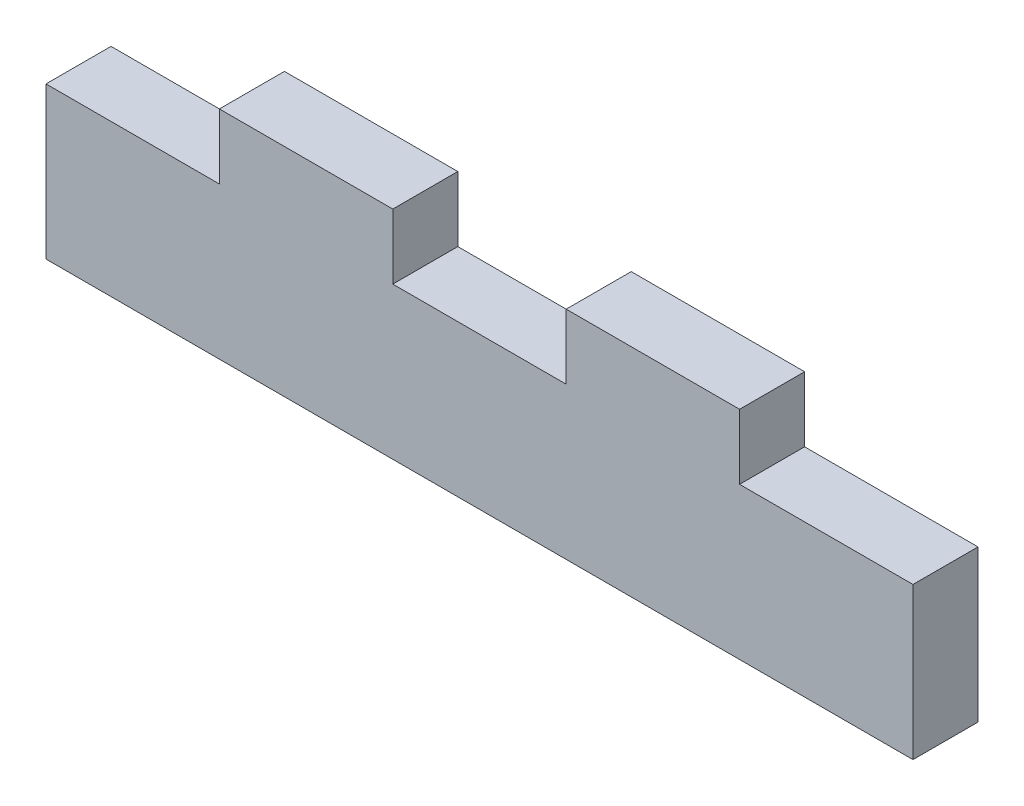
ISO-10303-21;
HEADER;
FILE_DESCRIPTION(('STEP AP214'),'2;1');
FILE_NAME('part.step','',(''),(''),'','','');
FILE_SCHEMA(('AUTOMOTIVE_DESIGN { 1 0 10303 214 1 1 1 1 }'));
ENDSEC;
DATA;
#1=APPLICATION_CONTEXT('core data for automotive mechanical design processes');
#2=APPLICATION_PROTOCOL_DEFINITION('international standard','automotive_design',2000,#1);
#3=PRODUCT_CONTEXT('',#1,'mechanical');
#4=PRODUCT('Part','Part','',(#3));
#5=PRODUCT_RELATED_PRODUCT_CATEGORY('part','',(#4));
#6=PRODUCT_DEFINITION_FORMATION('','',#4);
#7=PRODUCT_DEFINITION_CONTEXT('part definition',#1,'design');
#8=PRODUCT_DEFINITION('design','',#6,#7);
#9=PRODUCT_DEFINITION_SHAPE('','',#8);
#10=(LENGTH_UNIT() NAMED_UNIT(*) SI_UNIT(.MILLI.,.METRE.));
#11=(NAMED_UNIT(*) PLANE_ANGLE_UNIT() SI_UNIT($,.RADIAN.));
#12=(NAMED_UNIT(*) SI_UNIT($,.STERADIAN.) SOLID_ANGLE_UNIT());
#13=UNCERTAINTY_MEASURE_WITH_UNIT(LENGTH_MEASURE(1.E-05),#10,'distance_accuracy_value','');
#14=(GEOMETRIC_REPRESENTATION_CONTEXT(3) GLOBAL_UNCERTAINTY_ASSIGNED_CONTEXT((#13)) GLOBAL_UNIT_ASSIGNED_CONTEXT((#10,
#11,#12)) REPRESENTATION_CONTEXT('',''));
#15=CARTESIAN_POINT('',(0.,0.,0.));
#16=DIRECTION('',(0.,0.,1.));
#17=DIRECTION('',(1.,0.,0.));
#18=AXIS2_PLACEMENT_3D('',#15,#16,#17);
#19=CARTESIAN_POINT('',(20.,-5.,1.5));
#20=DIRECTION('',(-1.,0.,0.));
#21=DIRECTION('',(0.,0.,1.));
#22=AXIS2_PLACEMENT_3D('',#19,#20,#21);
#23=PLANE('',#22);
#24=DIRECTION('',(0.,0.,-1.));
#25=VECTOR('',#24,1.);
#26=CARTESIAN_POINT('',(20.,2.,-1.5));
#27=LINE('',#26,#25);
#28=CARTESIAN_POINT('',(20.,2.,1.5));
#29=VERTEX_POINT('',#28);
#30=CARTESIAN_POINT('',(20.,2.,-1.5));
#31=VERTEX_POINT('',#30);
#32=EDGE_CURVE('E143',#29,#31,#27,.T.);
#33=ORIENTED_EDGE('',*,*,#32,.F.);
#34=DIRECTION('',(0.,1.,0.));
#35=VECTOR('',#34,1.);
#36=CARTESIAN_POINT('',(20.,-5.,1.5));
#37=LINE('',#36,#35);
#38=CARTESIAN_POINT('',(20.,-5.,1.5));
#39=VERTEX_POINT('',#38);
#40=EDGE_CURVE('E151',#39,#29,#37,.T.);
#41=ORIENTED_EDGE('',*,*,#40,.F.);
#42=DIRECTION('',(0.,0.,-1.));
#43=VECTOR('',#42,1.);
#44=CARTESIAN_POINT('',(20.,-5.,1.5));
#45=LINE('',#44,#43);
#46=CARTESIAN_POINT('',(20.,-5.,-1.5));
#47=VERTEX_POINT('',#46);
#48=EDGE_CURVE('E162',#39,#47,#45,.T.);
#49=ORIENTED_EDGE('',*,*,#48,.T.);
#50=DIRECTION('',(0.,1.,0.));
#51=VECTOR('',#50,1.);
#52=CARTESIAN_POINT('',(20.,-5.,-1.5));
#53=LINE('',#52,#51);
#54=EDGE_CURVE('E132',#47,#31,#53,.T.);
#55=ORIENTED_EDGE('',*,*,#54,.T.);
#56=EDGE_LOOP('',(#33,#41,#49,#55));
#57=FACE_BOUND('',#56,.T.);
#58=ADVANCED_FACE('F35',(#57),#23,.F.);
#59=CARTESIAN_POINT('',(-20.,5.,1.5));
#60=DIRECTION('',(0.,-1.,0.));
#61=DIRECTION('',(0.,0.,-1.));
#62=AXIS2_PLACEMENT_3D('',#59,#60,#61);
#63=PLANE('',#62);
#64=DIRECTION('',(0.,0.,-1.));
#65=VECTOR('',#64,1.);
#66=CARTESIAN_POINT('',(-12.,5.,1.5));
#67=LINE('',#66,#65);
#68=CARTESIAN_POINT('',(-12.,5.,1.5));
#69=VERTEX_POINT('',#68);
#70=CARTESIAN_POINT('',(-12.,5.,-1.5));
#71=VERTEX_POINT('',#70);
#72=EDGE_CURVE('E127',#69,#71,#67,.T.);
#73=ORIENTED_EDGE('',*,*,#72,.F.);
#74=DIRECTION('',(-1.,0.,0.));
#75=VECTOR('',#74,1.);
#76=CARTESIAN_POINT('',(-20.,5.,1.5));
#77=LINE('',#76,#75);
#78=CARTESIAN_POINT('',(-4.,5.,1.5));
#79=VERTEX_POINT('',#78);
#80=EDGE_CURVE('E139',#79,#69,#77,.T.);
#81=ORIENTED_EDGE('',*,*,#80,.F.);
#82=DIRECTION('',(0.,0.,1.));
#83=VECTOR('',#82,1.);
#84=CARTESIAN_POINT('',(-4.,5.,-1.5));
#85=LINE('',#84,#83);
#86=CARTESIAN_POINT('',(-4.,5.,-1.5));
#87=VERTEX_POINT('',#86);
#88=EDGE_CURVE('E142',#87,#79,#85,.T.);
#89=ORIENTED_EDGE('',*,*,#88,.F.);
#90=DIRECTION('',(-1.,0.,0.));
#91=VECTOR('',#90,1.);
#92=CARTESIAN_POINT('',(-20.,5.,-1.5));
#93=LINE('',#92,#91);
#94=EDGE_CURVE('E141',#87,#71,#93,.T.);
#95=ORIENTED_EDGE('',*,*,#94,.T.);
#96=EDGE_LOOP('',(#73,#81,#89,#95));
#97=FACE_BOUND('',#96,.T.);
#98=ADVANCED_FACE('F137',(#97),#63,.F.);
#99=DIRECTION('',(0.,0.,-1.));
#100=VECTOR('',#99,1.);
#101=CARTESIAN_POINT('',(4.,5.,1.5));
#102=LINE('',#101,#100);
#103=CARTESIAN_POINT('',(4.,5.,1.5));
#104=VERTEX_POINT('',#103);
#105=CARTESIAN_POINT('',(4.,5.,-1.5));
#106=VERTEX_POINT('',#105);
#107=EDGE_CURVE('E224',#104,#106,#102,.T.);
#108=ORIENTED_EDGE('',*,*,#107,.F.);
#109=CARTESIAN_POINT('',(12.,5.,1.5));
#110=VERTEX_POINT('',#109);
#111=EDGE_CURVE('E150',#110,#104,#77,.T.);
#112=ORIENTED_EDGE('',*,*,#111,.F.);
#113=DIRECTION('',(0.,0.,1.));
#114=VECTOR('',#113,1.);
#115=CARTESIAN_POINT('',(12.,5.,-1.5));
#116=LINE('',#115,#114);
#117=CARTESIAN_POINT('',(12.,5.,-1.5));
#118=VERTEX_POINT('',#117);
#119=EDGE_CURVE('E212',#118,#110,#116,.T.);
#120=ORIENTED_EDGE('',*,*,#119,.F.);
#121=EDGE_CURVE('E166',#118,#106,#93,.T.);
#122=ORIENTED_EDGE('',*,*,#121,.T.);
#123=EDGE_LOOP('',(#108,#112,#120,#122));
#124=FACE_BOUND('',#123,.T.);
#125=ADVANCED_FACE('F226',(#124),#63,.F.);
#126=CARTESIAN_POINT('',(-20.,-5.,1.5));
#127=DIRECTION('',(1.,0.,0.));
#128=DIRECTION('',(0.,0.,-1.));
#129=AXIS2_PLACEMENT_3D('',#126,#127,#128);
#130=PLANE('',#129);
#131=DIRECTION('',(0.,0.,1.));
#132=VECTOR('',#131,1.);
#133=CARTESIAN_POINT('',(-20.,2.,-1.5));
#134=LINE('',#133,#132);
#135=CARTESIAN_POINT('',(-20.,2.,-1.5));
#136=VERTEX_POINT('',#135);
#137=CARTESIAN_POINT('',(-20.,2.,1.5));
#138=VERTEX_POINT('',#137);
#139=EDGE_CURVE('E232',#136,#138,#134,.T.);
#140=ORIENTED_EDGE('',*,*,#139,.F.);
#141=DIRECTION('',(0.,-1.,0.));
#142=VECTOR('',#141,1.);
#143=CARTESIAN_POINT('',(-20.,-5.,-1.5));
#144=LINE('',#143,#142);
#145=CARTESIAN_POINT('',(-20.,-5.,-1.5));
#146=VERTEX_POINT('',#145);
#147=EDGE_CURVE('E167',#136,#146,#144,.T.);
#148=ORIENTED_EDGE('',*,*,#147,.T.);
#149=DIRECTION('',(0.,0.,-1.));
#150=VECTOR('',#149,1.);
#151=CARTESIAN_POINT('',(-20.,-5.,1.5));
#152=LINE('',#151,#150);
#153=CARTESIAN_POINT('',(-20.,-5.,1.5));
#154=VERTEX_POINT('',#153);
#155=EDGE_CURVE('E171',#154,#146,#152,.T.);
#156=ORIENTED_EDGE('',*,*,#155,.F.);
#157=DIRECTION('',(0.,-1.,0.));
#158=VECTOR('',#157,1.);
#159=CARTESIAN_POINT('',(-20.,-5.,1.5));
#160=LINE('',#159,#158);
#161=EDGE_CURVE('E154',#138,#154,#160,.T.);
#162=ORIENTED_EDGE('',*,*,#161,.F.);
#163=EDGE_LOOP('',(#140,#148,#156,#162));
#164=FACE_BOUND('',#163,.T.);
#165=ADVANCED_FACE('F238',(#164),#130,.F.);
#166=CARTESIAN_POINT('',(0.,0.,1.5));
#167=DIRECTION('',(0.,0.,-1.));
#168=DIRECTION('',(-1.,0.,0.));
#169=AXIS2_PLACEMENT_3D('',#166,#167,#168);
#170=PLANE('',#169);
#171=DIRECTION('',(0.,-1.,0.));
#172=VECTOR('',#171,1.);
#173=CARTESIAN_POINT('',(-12.,5.,1.5));
#174=LINE('',#173,#172);
#175=CARTESIAN_POINT('',(-12.,2.,1.5));
#176=VERTEX_POINT('',#175);
#177=EDGE_CURVE('E124',#69,#176,#174,.T.);
#178=ORIENTED_EDGE('',*,*,#177,.T.);
#179=DIRECTION('',(1.,0.,0.));
#180=VECTOR('',#179,1.);
#181=CARTESIAN_POINT('',(-20.,2.,1.5));
#182=LINE('',#181,#180);
#183=EDGE_CURVE('E198',#138,#176,#182,.T.);
#184=ORIENTED_EDGE('',*,*,#183,.F.);
#185=ORIENTED_EDGE('',*,*,#161,.T.);
#186=DIRECTION('',(1.,0.,0.));
#187=VECTOR('',#186,1.);
#188=CARTESIAN_POINT('',(-20.,-5.,1.5));
#189=LINE('',#188,#187);
#190=EDGE_CURVE('E160',#154,#39,#189,.T.);
#191=ORIENTED_EDGE('',*,*,#190,.T.);
#192=ORIENTED_EDGE('',*,*,#40,.T.);
#193=DIRECTION('',(1.,0.,0.));
#194=VECTOR('',#193,1.);
#195=CARTESIAN_POINT('',(12.,2.,1.5));
#196=LINE('',#195,#194);
#197=CARTESIAN_POINT('',(12.,2.,1.5));
#198=VERTEX_POINT('',#197);
#199=EDGE_CURVE('E205',#198,#29,#196,.T.);
#200=ORIENTED_EDGE('',*,*,#199,.F.);
#201=DIRECTION('',(0.,-1.,0.));
#202=VECTOR('',#201,1.);
#203=CARTESIAN_POINT('',(12.,5.,1.5));
#204=LINE('',#203,#202);
#205=EDGE_CURVE('E208',#110,#198,#204,.T.);
#206=ORIENTED_EDGE('',*,*,#205,.F.);
#207=ORIENTED_EDGE('',*,*,#111,.T.);
#208=DIRECTION('',(0.,-1.,0.));
#209=VECTOR('',#208,1.);
#210=CARTESIAN_POINT('',(4.,5.,1.5));
#211=LINE('',#210,#209);
#212=CARTESIAN_POINT('',(4.,2.,1.5));
#213=VERTEX_POINT('',#212);
#214=EDGE_CURVE('E215',#104,#213,#211,.T.);
#215=ORIENTED_EDGE('',*,*,#214,.T.);
#216=DIRECTION('',(1.,0.,0.));
#217=VECTOR('',#216,1.);
#218=CARTESIAN_POINT('',(-4.,2.,1.5));
#219=LINE('',#218,#217);
#220=CARTESIAN_POINT('',(-4.,2.,1.5));
#221=VERTEX_POINT('',#220);
#222=EDGE_CURVE('E195',#221,#213,#219,.T.);
#223=ORIENTED_EDGE('',*,*,#222,.F.);
#224=DIRECTION('',(0.,-1.,0.));
#225=VECTOR('',#224,1.);
#226=CARTESIAN_POINT('',(-4.,5.,1.5));
#227=LINE('',#226,#225);
#228=EDGE_CURVE('E149',#79,#221,#227,.T.);
#229=ORIENTED_EDGE('',*,*,#228,.F.);
#230=ORIENTED_EDGE('',*,*,#80,.T.);
#231=EDGE_LOOP('',(#178,#184,#185,#191,#192,#200,#206,#207,#215,#223,#229,#230));
#232=FACE_BOUND('',#231,.T.);
#233=ADVANCED_FACE('F146',(#232),#170,.F.);
#234=CARTESIAN_POINT('',(0.,0.,-1.5));
#235=DIRECTION('',(0.,0.,-1.));
#236=DIRECTION('',(-1.,0.,0.));
#237=AXIS2_PLACEMENT_3D('',#234,#235,#236);
#238=PLANE('',#237);
#239=ORIENTED_EDGE('',*,*,#147,.F.);
#240=DIRECTION('',(1.,0.,0.));
#241=VECTOR('',#240,1.);
#242=CARTESIAN_POINT('',(0.,2.,-1.5));
#243=LINE('',#242,#241);
#244=CARTESIAN_POINT('',(-12.,2.,-1.5));
#245=VERTEX_POINT('',#244);
#246=EDGE_CURVE('E11',#136,#245,#243,.T.);
#247=ORIENTED_EDGE('',*,*,#246,.T.);
#248=DIRECTION('',(0.,-1.,0.));
#249=VECTOR('',#248,1.);
#250=CARTESIAN_POINT('',(-12.,5.,-1.5));
#251=LINE('',#250,#249);
#252=EDGE_CURVE('E50',#71,#245,#251,.T.);
#253=ORIENTED_EDGE('',*,*,#252,.F.);
#254=ORIENTED_EDGE('',*,*,#94,.F.);
#255=DIRECTION('',(0.,-1.,0.));
#256=VECTOR('',#255,1.);
#257=CARTESIAN_POINT('',(-4.,5.,-1.5));
#258=LINE('',#257,#256);
#259=CARTESIAN_POINT('',(-4.,2.,-1.5));
#260=VERTEX_POINT('',#259);
#261=EDGE_CURVE('E187',#87,#260,#258,.T.);
#262=ORIENTED_EDGE('',*,*,#261,.T.);
#263=CARTESIAN_POINT('',(4.,2.,-1.5));
#264=VERTEX_POINT('',#263);
#265=EDGE_CURVE('E43',#260,#264,#243,.T.);
#266=ORIENTED_EDGE('',*,*,#265,.T.);
#267=DIRECTION('',(0.,-1.,0.));
#268=VECTOR('',#267,1.);
#269=CARTESIAN_POINT('',(4.,5.,-1.5));
#270=LINE('',#269,#268);
#271=EDGE_CURVE('E58',#106,#264,#270,.T.);
#272=ORIENTED_EDGE('',*,*,#271,.F.);
#273=ORIENTED_EDGE('',*,*,#121,.F.);
#274=DIRECTION('',(0.,-1.,0.));
#275=VECTOR('',#274,1.);
#276=CARTESIAN_POINT('',(12.,5.,-1.5));
#277=LINE('',#276,#275);
#278=CARTESIAN_POINT('',(12.,2.,-1.5));
#279=VERTEX_POINT('',#278);
#280=EDGE_CURVE('E211',#118,#279,#277,.T.);
#281=ORIENTED_EDGE('',*,*,#280,.T.);
#282=EDGE_CURVE('E38',#279,#31,#243,.T.);
#283=ORIENTED_EDGE('',*,*,#282,.T.);
#284=ORIENTED_EDGE('',*,*,#54,.F.);
#285=DIRECTION('',(1.,0.,0.));
#286=VECTOR('',#285,1.);
#287=CARTESIAN_POINT('',(-20.,-5.,-1.5));
#288=LINE('',#287,#286);
#289=EDGE_CURVE('E156',#146,#47,#288,.T.);
#290=ORIENTED_EDGE('',*,*,#289,.F.);
#291=EDGE_LOOP('',(#239,#247,#253,#254,#262,#266,#272,#273,#281,#283,#284,#290));
#292=FACE_BOUND('',#291,.T.);
#293=ADVANCED_FACE('F184',(#292),#238,.T.);
#294=CARTESIAN_POINT('',(-20.,-5.,1.5));
#295=DIRECTION('',(0.,1.,0.));
#296=DIRECTION('',(0.,0.,1.));
#297=AXIS2_PLACEMENT_3D('',#294,#295,#296);
#298=PLANE('',#297);
#299=ORIENTED_EDGE('',*,*,#289,.T.);
#300=ORIENTED_EDGE('',*,*,#48,.F.);
#301=ORIENTED_EDGE('',*,*,#190,.F.);
#302=ORIENTED_EDGE('',*,*,#155,.T.);
#303=EDGE_LOOP('',(#299,#300,#301,#302));
#304=FACE_BOUND('',#303,.T.);
#305=ADVANCED_FACE('F240',(#304),#298,.F.);
#306=CARTESIAN_POINT('',(0.,2.,-5.));
#307=DIRECTION('',(0.,1.,0.));
#308=DIRECTION('',(0.,0.,1.));
#309=AXIS2_PLACEMENT_3D('',#306,#307,#308);
#310=PLANE('',#309);
#311=DIRECTION('',(0.,0.,1.));
#312=VECTOR('',#311,1.);
#313=CARTESIAN_POINT('',(12.,2.,-1.5));
#314=LINE('',#313,#312);
#315=EDGE_CURVE('E203',#279,#198,#314,.T.);
#316=ORIENTED_EDGE('',*,*,#315,.T.);
#317=ORIENTED_EDGE('',*,*,#199,.T.);
#318=ORIENTED_EDGE('',*,*,#32,.T.);
#319=ORIENTED_EDGE('',*,*,#282,.F.);
#320=EDGE_LOOP('',(#316,#317,#318,#319));
#321=FACE_BOUND('',#320,.T.);
#322=ADVANCED_FACE('F246',(#321),#310,.T.);
#323=CARTESIAN_POINT('',(12.,5.,-1.5));
#324=DIRECTION('',(1.,0.,0.));
#325=DIRECTION('',(0.,0.,-1.));
#326=AXIS2_PLACEMENT_3D('',#323,#324,#325);
#327=PLANE('',#326);
#328=ORIENTED_EDGE('',*,*,#315,.F.);
#329=ORIENTED_EDGE('',*,*,#280,.F.);
#330=ORIENTED_EDGE('',*,*,#119,.T.);
#331=ORIENTED_EDGE('',*,*,#205,.T.);
#332=EDGE_LOOP('',(#328,#329,#330,#331));
#333=FACE_BOUND('',#332,.T.);
#334=ADVANCED_FACE('F249',(#333),#327,.T.);
#335=DIRECTION('',(0.,0.,1.));
#336=VECTOR('',#335,1.);
#337=CARTESIAN_POINT('',(-4.,2.,-1.5));
#338=LINE('',#337,#336);
#339=EDGE_CURVE('E191',#260,#221,#338,.T.);
#340=ORIENTED_EDGE('',*,*,#339,.T.);
#341=ORIENTED_EDGE('',*,*,#222,.T.);
#342=DIRECTION('',(0.,0.,-1.));
#343=VECTOR('',#342,1.);
#344=CARTESIAN_POINT('',(4.,2.,1.5));
#345=LINE('',#344,#343);
#346=EDGE_CURVE('E192',#213,#264,#345,.T.);
#347=ORIENTED_EDGE('',*,*,#346,.T.);
#348=ORIENTED_EDGE('',*,*,#265,.F.);
#349=EDGE_LOOP('',(#340,#341,#347,#348));
#350=FACE_BOUND('',#349,.T.);
#351=ADVANCED_FACE('F190',(#350),#310,.T.);
#352=CARTESIAN_POINT('',(4.,5.,1.5));
#353=DIRECTION('',(-1.,0.,0.));
#354=DIRECTION('',(0.,0.,1.));
#355=AXIS2_PLACEMENT_3D('',#352,#353,#354);
#356=PLANE('',#355);
#357=ORIENTED_EDGE('',*,*,#346,.F.);
#358=ORIENTED_EDGE('',*,*,#214,.F.);
#359=ORIENTED_EDGE('',*,*,#107,.T.);
#360=ORIENTED_EDGE('',*,*,#271,.T.);
#361=EDGE_LOOP('',(#357,#358,#359,#360));
#362=FACE_BOUND('',#361,.T.);
#363=ADVANCED_FACE('F223',(#362),#356,.T.);
#364=CARTESIAN_POINT('',(-4.,5.,-1.5));
#365=DIRECTION('',(1.,0.,0.));
#366=DIRECTION('',(0.,0.,-1.));
#367=AXIS2_PLACEMENT_3D('',#364,#365,#366);
#368=PLANE('',#367);
#369=ORIENTED_EDGE('',*,*,#339,.F.);
#370=ORIENTED_EDGE('',*,*,#261,.F.);
#371=ORIENTED_EDGE('',*,*,#88,.T.);
#372=ORIENTED_EDGE('',*,*,#228,.T.);
#373=EDGE_LOOP('',(#369,#370,#371,#372));
#374=FACE_BOUND('',#373,.T.);
#375=ADVANCED_FACE('F194',(#374),#368,.T.);
#376=ORIENTED_EDGE('',*,*,#139,.T.);
#377=ORIENTED_EDGE('',*,*,#183,.T.);
#378=DIRECTION('',(0.,0.,-1.));
#379=VECTOR('',#378,1.);
#380=CARTESIAN_POINT('',(-12.,2.,1.5));
#381=LINE('',#380,#379);
#382=EDGE_CURVE('E128',#176,#245,#381,.T.);
#383=ORIENTED_EDGE('',*,*,#382,.T.);
#384=ORIENTED_EDGE('',*,*,#246,.F.);
#385=EDGE_LOOP('',(#376,#377,#383,#384));
#386=FACE_BOUND('',#385,.T.);
#387=ADVANCED_FACE('F234',(#386),#310,.T.);
#388=CARTESIAN_POINT('',(-12.,5.,1.5));
#389=DIRECTION('',(-1.,0.,0.));
#390=DIRECTION('',(0.,0.,1.));
#391=AXIS2_PLACEMENT_3D('',#388,#389,#390);
#392=PLANE('',#391);
#393=ORIENTED_EDGE('',*,*,#382,.F.);
#394=ORIENTED_EDGE('',*,*,#177,.F.);
#395=ORIENTED_EDGE('',*,*,#72,.T.);
#396=ORIENTED_EDGE('',*,*,#252,.T.);
#397=EDGE_LOOP('',(#393,#394,#395,#396));
#398=FACE_BOUND('',#397,.T.);
#399=ADVANCED_FACE('F126',(#398),#392,.T.);
#400=CLOSED_SHELL('',(#58,#98,#125,#165,#233,#293,#305,#322,#334,#351,#363,#375,#387,#399));
#401=MANIFOLD_SOLID_BREP('B2',#400);
#402=ADVANCED_BREP_SHAPE_REPRESENTATION('',(#18,#401),#14);
#403=SHAPE_DEFINITION_REPRESENTATION(#9,#402);
ENDSEC;
END-ISO-10303-21;
